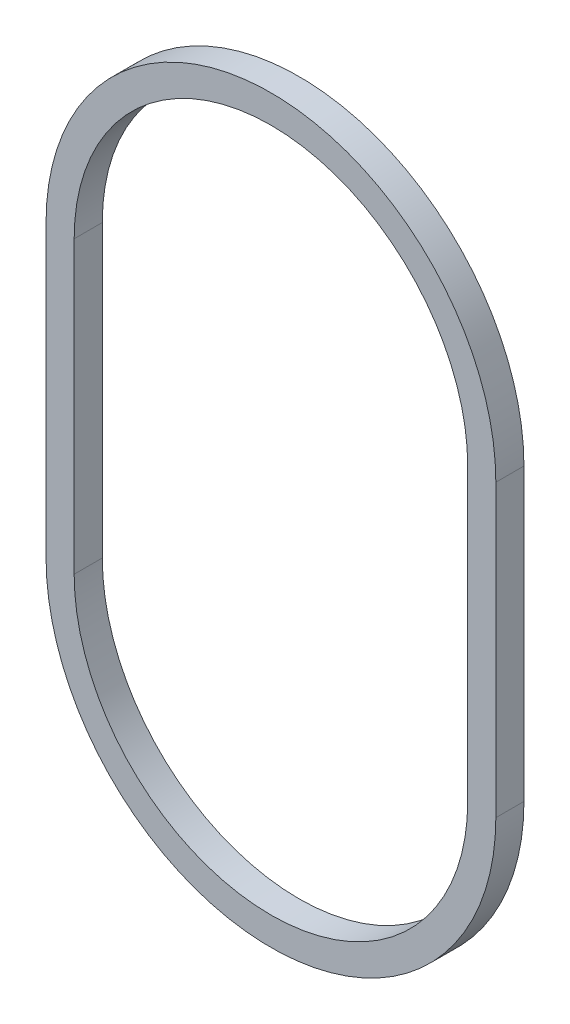
ISO-10303-21;
HEADER;
FILE_DESCRIPTION(('STEP AP214'),'2;1');
FILE_NAME('part.step','',(''),(''),'','','');
FILE_SCHEMA(('AUTOMOTIVE_DESIGN { 1 0 10303 214 1 1 1 1 }'));
ENDSEC;
DATA;
#1=APPLICATION_CONTEXT('core data for automotive mechanical design processes');
#2=APPLICATION_PROTOCOL_DEFINITION('international standard','automotive_design',2000,#1);
#3=PRODUCT_CONTEXT('',#1,'mechanical');
#4=PRODUCT('Part','Part','',(#3));
#5=PRODUCT_RELATED_PRODUCT_CATEGORY('part','',(#4));
#6=PRODUCT_DEFINITION_FORMATION('','',#4);
#7=PRODUCT_DEFINITION_CONTEXT('part definition',#1,'design');
#8=PRODUCT_DEFINITION('design','',#6,#7);
#9=PRODUCT_DEFINITION_SHAPE('','',#8);
#10=(LENGTH_UNIT() NAMED_UNIT(*) SI_UNIT(.MILLI.,.METRE.));
#11=(NAMED_UNIT(*) PLANE_ANGLE_UNIT() SI_UNIT($,.RADIAN.));
#12=(NAMED_UNIT(*) SI_UNIT($,.STERADIAN.) SOLID_ANGLE_UNIT());
#13=UNCERTAINTY_MEASURE_WITH_UNIT(LENGTH_MEASURE(1.E-05),#10,'distance_accuracy_value','');
#14=(GEOMETRIC_REPRESENTATION_CONTEXT(3) GLOBAL_UNCERTAINTY_ASSIGNED_CONTEXT((#13)) GLOBAL_UNIT_ASSIGNED_CONTEXT((#10,
#11,#12)) REPRESENTATION_CONTEXT('',''));
#15=CARTESIAN_POINT('',(0.,0.,0.));
#16=DIRECTION('',(0.,0.,1.));
#17=DIRECTION('',(1.,0.,0.));
#18=AXIS2_PLACEMENT_3D('',#15,#16,#17);
#19=CARTESIAN_POINT('',(0.,0.,1.5));
#20=DIRECTION('',(0.,0.,1.));
#21=DIRECTION('',(1.,0.,0.));
#22=AXIS2_PLACEMENT_3D('',#19,#20,#21);
#23=PLANE('',#22);
#24=CARTESIAN_POINT('',(0.,0.,1.5));
#25=DIRECTION('',(0.,0.,1.));
#26=DIRECTION('',(1.,0.,0.));
#27=AXIS2_PLACEMENT_3D('',#24,#25,#26);
#28=CIRCLE('',#27,24.);
#29=CARTESIAN_POINT('',(24.,0.,1.5));
#30=VERTEX_POINT('',#29);
#31=CARTESIAN_POINT('',(-24.,0.,1.5));
#32=VERTEX_POINT('',#31);
#33=EDGE_CURVE('E138',#30,#32,#28,.T.);
#34=ORIENTED_EDGE('',*,*,#33,.T.);
#35=DIRECTION('',(0.,-1.,0.));
#36=VECTOR('',#35,1.);
#37=CARTESIAN_POINT('',(-24.,-31.,1.5));
#38=LINE('',#37,#36);
#39=CARTESIAN_POINT('',(-24.,-31.,1.5));
#40=VERTEX_POINT('',#39);
#41=EDGE_CURVE('E141',#32,#40,#38,.T.);
#42=ORIENTED_EDGE('',*,*,#41,.T.);
#43=CARTESIAN_POINT('',(0.,-31.,1.5));
#44=DIRECTION('',(0.,0.,1.));
#45=DIRECTION('',(1.,0.,0.));
#46=AXIS2_PLACEMENT_3D('',#43,#44,#45);
#47=CIRCLE('',#46,24.);
#48=CARTESIAN_POINT('',(24.,-31.,1.5));
#49=VERTEX_POINT('',#48);
#50=EDGE_CURVE('E144',#40,#49,#47,.T.);
#51=ORIENTED_EDGE('',*,*,#50,.T.);
#52=DIRECTION('',(0.,1.,0.));
#53=VECTOR('',#52,1.);
#54=CARTESIAN_POINT('',(24.,-31.,1.5));
#55=LINE('',#54,#53);
#56=EDGE_CURVE('E146',#49,#30,#55,.T.);
#57=ORIENTED_EDGE('',*,*,#56,.T.);
#58=EDGE_LOOP('',(#34,#42,#51,#57));
#59=FACE_BOUND('',#58,.T.);
#60=DIRECTION('',(0.,1.,0.));
#61=VECTOR('',#60,1.);
#62=CARTESIAN_POINT('',(21.,-31.,1.5));
#63=LINE('',#62,#61);
#64=CARTESIAN_POINT('',(21.,-31.,1.5));
#65=VERTEX_POINT('',#64);
#66=CARTESIAN_POINT('',(21.,0.,1.5));
#67=VERTEX_POINT('',#66);
#68=EDGE_CURVE('E110',#65,#67,#63,.T.);
#69=ORIENTED_EDGE('',*,*,#68,.F.);
#70=CARTESIAN_POINT('',(0.,-31.,1.5));
#71=DIRECTION('',(0.,0.,1.));
#72=DIRECTION('',(1.,0.,0.));
#73=AXIS2_PLACEMENT_3D('',#70,#71,#72);
#74=CIRCLE('',#73,21.);
#75=CARTESIAN_POINT('',(-21.,-31.,1.5));
#76=VERTEX_POINT('',#75);
#77=EDGE_CURVE('E102',#76,#65,#74,.T.);
#78=ORIENTED_EDGE('',*,*,#77,.F.);
#79=DIRECTION('',(0.,-1.,0.));
#80=VECTOR('',#79,1.);
#81=CARTESIAN_POINT('',(-21.,-31.,1.5));
#82=LINE('',#81,#80);
#83=CARTESIAN_POINT('',(-21.,0.,1.5));
#84=VERTEX_POINT('',#83);
#85=EDGE_CURVE('E124',#84,#76,#82,.T.);
#86=ORIENTED_EDGE('',*,*,#85,.F.);
#87=CARTESIAN_POINT('',(0.,0.,1.5));
#88=DIRECTION('',(0.,0.,1.));
#89=DIRECTION('',(1.,0.,0.));
#90=AXIS2_PLACEMENT_3D('',#87,#88,#89);
#91=CIRCLE('',#90,21.);
#92=EDGE_CURVE('E122',#67,#84,#91,.T.);
#93=ORIENTED_EDGE('',*,*,#92,.F.);
#94=EDGE_LOOP('',(#69,#78,#86,#93));
#95=FACE_BOUND('',#94,.T.);
#96=ADVANCED_FACE('F37',(#59,#95),#23,.T.);
#97=CARTESIAN_POINT('',(0.,0.,-1.5));
#98=DIRECTION('',(0.,0.,1.));
#99=DIRECTION('',(1.,0.,0.));
#100=AXIS2_PLACEMENT_3D('',#97,#98,#99);
#101=PLANE('',#100);
#102=CARTESIAN_POINT('',(0.,0.,-1.5));
#103=DIRECTION('',(0.,0.,1.));
#104=DIRECTION('',(1.,0.,0.));
#105=AXIS2_PLACEMENT_3D('',#102,#103,#104);
#106=CIRCLE('',#105,24.);
#107=CARTESIAN_POINT('',(24.,0.,-1.5));
#108=VERTEX_POINT('',#107);
#109=CARTESIAN_POINT('',(-24.,0.,-1.5));
#110=VERTEX_POINT('',#109);
#111=EDGE_CURVE('E118',#108,#110,#106,.T.);
#112=ORIENTED_EDGE('',*,*,#111,.F.);
#113=DIRECTION('',(0.,1.,0.));
#114=VECTOR('',#113,1.);
#115=CARTESIAN_POINT('',(24.,-31.,-1.5));
#116=LINE('',#115,#114);
#117=CARTESIAN_POINT('',(24.,-31.,-1.5));
#118=VERTEX_POINT('',#117);
#119=EDGE_CURVE('E142',#118,#108,#116,.T.);
#120=ORIENTED_EDGE('',*,*,#119,.F.);
#121=CARTESIAN_POINT('',(0.,-31.,-1.5));
#122=DIRECTION('',(0.,0.,1.));
#123=DIRECTION('',(1.,0.,0.));
#124=AXIS2_PLACEMENT_3D('',#121,#122,#123);
#125=CIRCLE('',#124,24.);
#126=CARTESIAN_POINT('',(-24.,-31.,-1.5));
#127=VERTEX_POINT('',#126);
#128=EDGE_CURVE('E153',#127,#118,#125,.T.);
#129=ORIENTED_EDGE('',*,*,#128,.F.);
#130=DIRECTION('',(0.,-1.,0.));
#131=VECTOR('',#130,1.);
#132=CARTESIAN_POINT('',(-24.,-31.,-1.5));
#133=LINE('',#132,#131);
#134=EDGE_CURVE('E151',#110,#127,#133,.T.);
#135=ORIENTED_EDGE('',*,*,#134,.F.);
#136=EDGE_LOOP('',(#112,#120,#129,#135));
#137=FACE_BOUND('',#136,.T.);
#138=CARTESIAN_POINT('',(0.,-31.,-1.5));
#139=DIRECTION('',(0.,0.,1.));
#140=DIRECTION('',(1.,0.,0.));
#141=AXIS2_PLACEMENT_3D('',#138,#139,#140);
#142=CIRCLE('',#141,21.);
#143=CARTESIAN_POINT('',(-21.,-31.,-1.5));
#144=VERTEX_POINT('',#143);
#145=CARTESIAN_POINT('',(21.,-31.,-1.5));
#146=VERTEX_POINT('',#145);
#147=EDGE_CURVE('E60',#144,#146,#142,.T.);
#148=ORIENTED_EDGE('',*,*,#147,.T.);
#149=DIRECTION('',(0.,1.,0.));
#150=VECTOR('',#149,1.);
#151=CARTESIAN_POINT('',(21.,-31.,-1.5));
#152=LINE('',#151,#150);
#153=CARTESIAN_POINT('',(21.,0.,-1.5));
#154=VERTEX_POINT('',#153);
#155=EDGE_CURVE('E117',#146,#154,#152,.T.);
#156=ORIENTED_EDGE('',*,*,#155,.T.);
#157=CARTESIAN_POINT('',(0.,0.,-1.5));
#158=DIRECTION('',(0.,0.,1.));
#159=DIRECTION('',(1.,0.,0.));
#160=AXIS2_PLACEMENT_3D('',#157,#158,#159);
#161=CIRCLE('',#160,21.);
#162=CARTESIAN_POINT('',(-21.,0.,-1.5));
#163=VERTEX_POINT('',#162);
#164=EDGE_CURVE('E130',#154,#163,#161,.T.);
#165=ORIENTED_EDGE('',*,*,#164,.T.);
#166=DIRECTION('',(0.,-1.,0.));
#167=VECTOR('',#166,1.);
#168=CARTESIAN_POINT('',(-21.,-31.,-1.5));
#169=LINE('',#168,#167);
#170=EDGE_CURVE('E111',#163,#144,#169,.T.);
#171=ORIENTED_EDGE('',*,*,#170,.T.);
#172=EDGE_LOOP('',(#148,#156,#165,#171));
#173=FACE_BOUND('',#172,.T.);
#174=ADVANCED_FACE('F171',(#137,#173),#101,.F.);
#175=CARTESIAN_POINT('',(0.,0.,1.5));
#176=DIRECTION('',(0.,0.,-1.));
#177=DIRECTION('',(-1.,0.,0.));
#178=AXIS2_PLACEMENT_3D('',#175,#176,#177);
#179=CYLINDRICAL_SURFACE('',#178,24.);
#180=ORIENTED_EDGE('',*,*,#111,.T.);
#181=DIRECTION('',(0.,0.,-1.));
#182=VECTOR('',#181,1.);
#183=CARTESIAN_POINT('',(-24.,0.,1.5));
#184=LINE('',#183,#182);
#185=EDGE_CURVE('E11',#32,#110,#184,.T.);
#186=ORIENTED_EDGE('',*,*,#185,.F.);
#187=ORIENTED_EDGE('',*,*,#33,.F.);
#188=DIRECTION('',(0.,0.,-1.));
#189=VECTOR('',#188,1.);
#190=CARTESIAN_POINT('',(24.,0.,1.5));
#191=LINE('',#190,#189);
#192=EDGE_CURVE('E148',#30,#108,#191,.T.);
#193=ORIENTED_EDGE('',*,*,#192,.T.);
#194=EDGE_LOOP('',(#180,#186,#187,#193));
#195=FACE_BOUND('',#194,.T.);
#196=ADVANCED_FACE('F39',(#195),#179,.T.);
#197=CARTESIAN_POINT('',(-24.,-31.,1.5));
#198=DIRECTION('',(1.,0.,0.));
#199=DIRECTION('',(0.,1.,0.));
#200=AXIS2_PLACEMENT_3D('',#197,#198,#199);
#201=PLANE('',#200);
#202=ORIENTED_EDGE('',*,*,#134,.T.);
#203=DIRECTION('',(0.,0.,-1.));
#204=VECTOR('',#203,1.);
#205=CARTESIAN_POINT('',(-24.,-31.,1.5));
#206=LINE('',#205,#204);
#207=EDGE_CURVE('E45',#40,#127,#206,.T.);
#208=ORIENTED_EDGE('',*,*,#207,.F.);
#209=ORIENTED_EDGE('',*,*,#41,.F.);
#210=ORIENTED_EDGE('',*,*,#185,.T.);
#211=EDGE_LOOP('',(#202,#208,#209,#210));
#212=FACE_BOUND('',#211,.T.);
#213=ADVANCED_FACE('F181',(#212),#201,.F.);
#214=CARTESIAN_POINT('',(0.,-31.,1.5));
#215=DIRECTION('',(0.,0.,-1.));
#216=DIRECTION('',(-1.,0.,0.));
#217=AXIS2_PLACEMENT_3D('',#214,#215,#216);
#218=CYLINDRICAL_SURFACE('',#217,24.);
#219=ORIENTED_EDGE('',*,*,#128,.T.);
#220=DIRECTION('',(0.,0.,-1.));
#221=VECTOR('',#220,1.);
#222=CARTESIAN_POINT('',(24.,-31.,1.5));
#223=LINE('',#222,#221);
#224=EDGE_CURVE('E158',#49,#118,#223,.T.);
#225=ORIENTED_EDGE('',*,*,#224,.F.);
#226=ORIENTED_EDGE('',*,*,#50,.F.);
#227=ORIENTED_EDGE('',*,*,#207,.T.);
#228=EDGE_LOOP('',(#219,#225,#226,#227));
#229=FACE_BOUND('',#228,.T.);
#230=ADVANCED_FACE('F165',(#229),#218,.T.);
#231=CARTESIAN_POINT('',(24.,-31.,1.5));
#232=DIRECTION('',(-1.,0.,0.));
#233=DIRECTION('',(0.,-1.,0.));
#234=AXIS2_PLACEMENT_3D('',#231,#232,#233);
#235=PLANE('',#234);
#236=ORIENTED_EDGE('',*,*,#119,.T.);
#237=ORIENTED_EDGE('',*,*,#192,.F.);
#238=ORIENTED_EDGE('',*,*,#56,.F.);
#239=ORIENTED_EDGE('',*,*,#224,.T.);
#240=EDGE_LOOP('',(#236,#237,#238,#239));
#241=FACE_BOUND('',#240,.T.);
#242=ADVANCED_FACE('F175',(#241),#235,.F.);
#243=CARTESIAN_POINT('',(0.,-31.,1.5));
#244=DIRECTION('',(0.,0.,-1.));
#245=DIRECTION('',(-1.,0.,0.));
#246=AXIS2_PLACEMENT_3D('',#243,#244,#245);
#247=CYLINDRICAL_SURFACE('',#246,21.);
#248=ORIENTED_EDGE('',*,*,#147,.F.);
#249=DIRECTION('',(0.,0.,-1.));
#250=VECTOR('',#249,1.);
#251=CARTESIAN_POINT('',(-21.,-31.,1.5));
#252=LINE('',#251,#250);
#253=EDGE_CURVE('E106',#76,#144,#252,.T.);
#254=ORIENTED_EDGE('',*,*,#253,.F.);
#255=ORIENTED_EDGE('',*,*,#77,.T.);
#256=DIRECTION('',(0.,0.,-1.));
#257=VECTOR('',#256,1.);
#258=CARTESIAN_POINT('',(21.,-31.,1.5));
#259=LINE('',#258,#257);
#260=EDGE_CURVE('E105',#65,#146,#259,.T.);
#261=ORIENTED_EDGE('',*,*,#260,.T.);
#262=EDGE_LOOP('',(#248,#254,#255,#261));
#263=FACE_BOUND('',#262,.T.);
#264=ADVANCED_FACE('F104',(#263),#247,.F.);
#265=CARTESIAN_POINT('',(21.,-31.,1.5));
#266=DIRECTION('',(-1.,0.,0.));
#267=DIRECTION('',(0.,0.,1.));
#268=AXIS2_PLACEMENT_3D('',#265,#266,#267);
#269=PLANE('',#268);
#270=ORIENTED_EDGE('',*,*,#155,.F.);
#271=ORIENTED_EDGE('',*,*,#260,.F.);
#272=ORIENTED_EDGE('',*,*,#68,.T.);
#273=DIRECTION('',(0.,0.,-1.));
#274=VECTOR('',#273,1.);
#275=CARTESIAN_POINT('',(21.,0.,1.5));
#276=LINE('',#275,#274);
#277=EDGE_CURVE('E119',#67,#154,#276,.T.);
#278=ORIENTED_EDGE('',*,*,#277,.T.);
#279=EDGE_LOOP('',(#270,#271,#272,#278));
#280=FACE_BOUND('',#279,.T.);
#281=ADVANCED_FACE('F114',(#280),#269,.T.);
#282=CARTESIAN_POINT('',(0.,0.,1.5));
#283=DIRECTION('',(0.,0.,-1.));
#284=DIRECTION('',(-1.,0.,0.));
#285=AXIS2_PLACEMENT_3D('',#282,#283,#284);
#286=CYLINDRICAL_SURFACE('',#285,21.);
#287=ORIENTED_EDGE('',*,*,#164,.F.);
#288=ORIENTED_EDGE('',*,*,#277,.F.);
#289=ORIENTED_EDGE('',*,*,#92,.T.);
#290=DIRECTION('',(0.,0.,-1.));
#291=VECTOR('',#290,1.);
#292=CARTESIAN_POINT('',(-21.,0.,1.5));
#293=LINE('',#292,#291);
#294=EDGE_CURVE('E52',#84,#163,#293,.T.);
#295=ORIENTED_EDGE('',*,*,#294,.T.);
#296=EDGE_LOOP('',(#287,#288,#289,#295));
#297=FACE_BOUND('',#296,.T.);
#298=ADVANCED_FACE('F204',(#297),#286,.F.);
#299=CARTESIAN_POINT('',(-21.,-31.,1.5));
#300=DIRECTION('',(1.,0.,0.));
#301=DIRECTION('',(0.,0.,-1.));
#302=AXIS2_PLACEMENT_3D('',#299,#300,#301);
#303=PLANE('',#302);
#304=ORIENTED_EDGE('',*,*,#170,.F.);
#305=ORIENTED_EDGE('',*,*,#294,.F.);
#306=ORIENTED_EDGE('',*,*,#85,.T.);
#307=ORIENTED_EDGE('',*,*,#253,.T.);
#308=EDGE_LOOP('',(#304,#305,#306,#307));
#309=FACE_BOUND('',#308,.T.);
#310=ADVANCED_FACE('F208',(#309),#303,.T.);
#311=CLOSED_SHELL('',(#96,#174,#196,#213,#230,#242,#264,#281,#298,#310));
#312=MANIFOLD_SOLID_BREP('B2',#311);
#313=ADVANCED_BREP_SHAPE_REPRESENTATION('',(#18,#312),#14);
#314=SHAPE_DEFINITION_REPRESENTATION(#9,#313);
ENDSEC;
END-ISO-10303-21;
